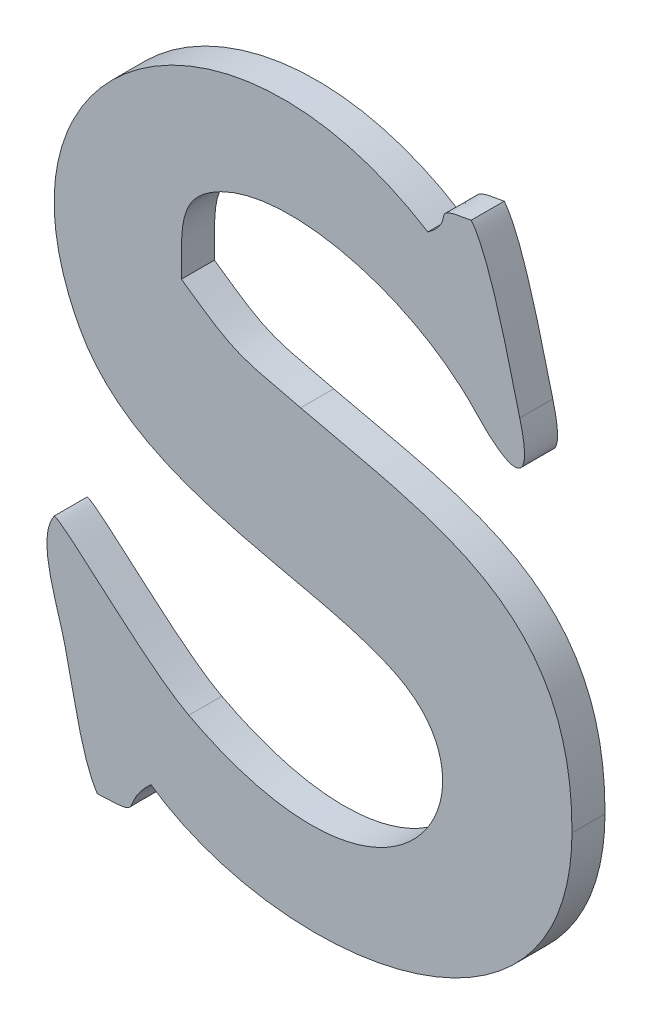
ISO-10303-21;
HEADER;
FILE_DESCRIPTION(('STEP AP214'),'2;1');
FILE_NAME('part.step','',(''),(''),'','','');
FILE_SCHEMA(('AUTOMOTIVE_DESIGN { 1 0 10303 214 1 1 1 1 }'));
ENDSEC;
DATA;
#1=APPLICATION_CONTEXT('core data for automotive mechanical design processes');
#2=APPLICATION_PROTOCOL_DEFINITION('international standard','automotive_design',2000,#1);
#3=PRODUCT_CONTEXT('',#1,'mechanical');
#4=PRODUCT('Part','Part','',(#3));
#5=PRODUCT_RELATED_PRODUCT_CATEGORY('part','',(#4));
#6=PRODUCT_DEFINITION_FORMATION('','',#4);
#7=PRODUCT_DEFINITION_CONTEXT('part definition',#1,'design');
#8=PRODUCT_DEFINITION('design','',#6,#7);
#9=PRODUCT_DEFINITION_SHAPE('','',#8);
#10=(LENGTH_UNIT() NAMED_UNIT(*) SI_UNIT(.MILLI.,.METRE.));
#11=(NAMED_UNIT(*) PLANE_ANGLE_UNIT() SI_UNIT($,.RADIAN.));
#12=(NAMED_UNIT(*) SI_UNIT($,.STERADIAN.) SOLID_ANGLE_UNIT());
#13=UNCERTAINTY_MEASURE_WITH_UNIT(LENGTH_MEASURE(1.E-05),#10,'distance_accuracy_value','');
#14=(GEOMETRIC_REPRESENTATION_CONTEXT(3) GLOBAL_UNCERTAINTY_ASSIGNED_CONTEXT((#13)) GLOBAL_UNIT_ASSIGNED_CONTEXT((#10,
#11,#12)) REPRESENTATION_CONTEXT('',''));
#15=CARTESIAN_POINT('',(0.,0.,0.));
#16=DIRECTION('',(0.,0.,1.));
#17=DIRECTION('',(1.,0.,0.));
#18=AXIS2_PLACEMENT_3D('',#15,#16,#17);
#19=CARTESIAN_POINT('',(50.1611139999998,11.206737,0.001));
#20=CARTESIAN_POINT('',(50.1611139999998,11.206737,0.));
#21=CARTESIAN_POINT('',(50.1640959999998,11.204861,0.001));
#22=CARTESIAN_POINT('',(50.1640959999998,11.204861,0.));
#23=CARTESIAN_POINT('',(50.1607779999998,11.199415,0.001));
#24=CARTESIAN_POINT('',(50.1607779999998,11.199415,0.));
#25=CARTESIAN_POINT('',(50.1545339999998,11.202691,0.001));
#26=CARTESIAN_POINT('',(50.1545339999998,11.202691,0.));
#27=B_SPLINE_SURFACE_WITH_KNOTS('',3,1,((#19,#20),(#21,#22),(#23,#24),(#25,#26)),.UNSPECIFIED.,
.F.,.F.,.F.,(4,4),(2,2),(0.8125,0.875),(0.,1.),.UNSPECIFIED.);
#28=CARTESIAN_POINT('',(50.1611139999998,11.206737,0.));
#29=CARTESIAN_POINT('',(50.1640959999998,11.204861,0.));
#30=CARTESIAN_POINT('',(50.1607779999998,11.199415,0.));
#31=CARTESIAN_POINT('',(50.1545339999998,11.202691,0.));
#32=B_SPLINE_CURVE_WITH_KNOTS('',3,(#28,#29,#30,#31),.UNSPECIFIED.,.F.,.F.,(4,4),(0.8125,0.875),.UNSPECIFIED.);
#33=CARTESIAN_POINT('',(50.1611139999998,11.206737,0.));
#34=VERTEX_POINT('',#33);
#35=CARTESIAN_POINT('',(50.1545339999998,11.202691,0.));
#36=VERTEX_POINT('',#35);
#37=EDGE_CURVE('E11',#34,#36,#32,.T.);
#38=DIRECTION('',(0.,0.,-1.));
#39=VECTOR('',#38,1.);
#40=CARTESIAN_POINT('',(50.1545339999998,11.202691,0.001));
#41=LINE('',#40,#39);
#42=CARTESIAN_POINT('',(50.1545339999998,11.202691,0.001));
#43=VERTEX_POINT('',#42);
#44=EDGE_CURVE('E28',#43,#36,#41,.T.);
#45=CARTESIAN_POINT('',(50.1611139999998,11.206737,0.001));
#46=CARTESIAN_POINT('',(50.1640959999998,11.204861,0.001));
#47=CARTESIAN_POINT('',(50.1607779999998,11.199415,0.001));
#48=CARTESIAN_POINT('',(50.1545339999998,11.202691,0.001));
#49=B_SPLINE_CURVE_WITH_KNOTS('',3,(#45,#46,#47,#48),.UNSPECIFIED.,.F.,.F.,(4,4),(0.8125,0.875),.UNSPECIFIED.);
#50=CARTESIAN_POINT('',(50.1611139999998,11.206737,0.001));
#51=VERTEX_POINT('',#50);
#52=EDGE_CURVE('E375',#51,#43,#49,.T.);
#53=DIRECTION('',(0.,0.,-1.));
#54=VECTOR('',#53,1.);
#55=CARTESIAN_POINT('',(50.1611139999998,11.206737,0.001));
#56=LINE('',#55,#54);
#57=EDGE_CURVE('E40',#51,#34,#56,.T.);
#58=ORIENTED_EDGE('',*,*,#37,.T.);
#59=ORIENTED_EDGE('',*,*,#44,.F.);
#60=ORIENTED_EDGE('',*,*,#52,.F.);
#61=ORIENTED_EDGE('',*,*,#57,.T.);
#62=EDGE_LOOP('',(#58,#59,#60,#61));
#63=FACE_BOUND('',#62,.T.);
#64=ADVANCED_FACE('F17',(#63),#27,.F.);
#65=CARTESIAN_POINT('',(50.1545339999998,11.202691,0.001));
#66=CARTESIAN_POINT('',(50.1545339999998,11.202691,0.));
#67=CARTESIAN_POINT('',(50.1532039999998,11.203391,0.001));
#68=CARTESIAN_POINT('',(50.1532039999998,11.203391,0.));
#69=CARTESIAN_POINT('',(50.1509219999998,11.205729,0.001));
#70=CARTESIAN_POINT('',(50.1509219999998,11.205729,0.));
#71=CARTESIAN_POINT('',(50.1504599999998,11.205883,0.001));
#72=CARTESIAN_POINT('',(50.1504599999998,11.205883,0.));
#73=B_SPLINE_SURFACE_WITH_KNOTS('',3,1,((#65,#66),(#67,#68),(#69,#70),(#71,#72)),.UNSPECIFIED.,
.F.,.F.,.F.,(4,4),(2,2),(0.875,1.),(0.,1.),.UNSPECIFIED.);
#74=CARTESIAN_POINT('',(50.1545339999998,11.202691,0.));
#75=CARTESIAN_POINT('',(50.1532039999998,11.203391,0.));
#76=CARTESIAN_POINT('',(50.1509219999998,11.205729,0.));
#77=CARTESIAN_POINT('',(50.1504599999998,11.205883,0.));
#78=B_SPLINE_CURVE_WITH_KNOTS('',3,(#74,#75,#76,#77),.UNSPECIFIED.,.F.,.F.,(4,4),(0.875,1.),.UNSPECIFIED.);
#79=CARTESIAN_POINT('',(50.1504599999998,11.205883,0.));
#80=VERTEX_POINT('',#79);
#81=EDGE_CURVE('E367',#36,#80,#78,.T.);
#82=DIRECTION('',(0.,0.,-1.));
#83=VECTOR('',#82,1.);
#84=CARTESIAN_POINT('',(50.1504599999998,11.205883,0.001));
#85=LINE('',#84,#83);
#86=CARTESIAN_POINT('',(50.1504599999998,11.205883,0.001));
#87=VERTEX_POINT('',#86);
#88=EDGE_CURVE('E362',#87,#80,#85,.T.);
#89=CARTESIAN_POINT('',(50.1545339999998,11.202691,0.001));
#90=CARTESIAN_POINT('',(50.1532039999998,11.203391,0.001));
#91=CARTESIAN_POINT('',(50.1509219999998,11.205729,0.001));
#92=CARTESIAN_POINT('',(50.1504599999998,11.205883,0.001));
#93=B_SPLINE_CURVE_WITH_KNOTS('',3,(#89,#90,#91,#92),.UNSPECIFIED.,.F.,.F.,(4,4),(0.875,1.),.UNSPECIFIED.);
#94=EDGE_CURVE('E355',#43,#87,#93,.T.);
#95=ORIENTED_EDGE('',*,*,#81,.T.);
#96=ORIENTED_EDGE('',*,*,#88,.F.);
#97=ORIENTED_EDGE('',*,*,#94,.F.);
#98=ORIENTED_EDGE('',*,*,#44,.T.);
#99=EDGE_LOOP('',(#95,#96,#97,#98));
#100=FACE_BOUND('',#99,.T.);
#101=ADVANCED_FACE('F383',(#100),#73,.F.);
#102=CARTESIAN_POINT('',(50.1504599999998,11.205883,0.001));
#103=CARTESIAN_POINT('',(50.1504599999998,11.205883,0.));
#104=CARTESIAN_POINT('',(50.1498999999998,11.205057,0.001));
#105=CARTESIAN_POINT('',(50.1498999999998,11.205057,0.));
#106=CARTESIAN_POINT('',(50.1505439999998,11.203657,0.001));
#107=CARTESIAN_POINT('',(50.1505439999998,11.203657,0.));
#108=CARTESIAN_POINT('',(50.1507819999998,11.202649,0.001));
#109=CARTESIAN_POINT('',(50.1507819999998,11.202649,0.));
#110=B_SPLINE_SURFACE_WITH_KNOTS('',3,1,((#102,#103),(#104,#105),(#106,#107),(#108,#109)),
.UNSPECIFIED.,.F.,.F.,.F.,(4,4),(2,2),(0.,0.0625),(0.,1.),.UNSPECIFIED.);
#111=CARTESIAN_POINT('',(50.1504599999998,11.205883,0.));
#112=CARTESIAN_POINT('',(50.1498999999998,11.205057,0.));
#113=CARTESIAN_POINT('',(50.1505439999998,11.203657,0.));
#114=CARTESIAN_POINT('',(50.1507819999998,11.202649,0.));
#115=B_SPLINE_CURVE_WITH_KNOTS('',3,(#111,#112,#113,#114),.UNSPECIFIED.,.F.,.F.,(4,4),(0.,
0.0625),.UNSPECIFIED.);
#116=CARTESIAN_POINT('',(50.1507819999998,11.202649,0.));
#117=VERTEX_POINT('',#116);
#118=EDGE_CURVE('E350',#80,#117,#115,.T.);
#119=DIRECTION('',(0.,0.,-1.));
#120=VECTOR('',#119,1.);
#121=CARTESIAN_POINT('',(50.1507819999998,11.202649,0.001));
#122=LINE('',#121,#120);
#123=CARTESIAN_POINT('',(50.1507819999998,11.202649,0.001));
#124=VERTEX_POINT('',#123);
#125=EDGE_CURVE('E345',#124,#117,#122,.T.);
#126=CARTESIAN_POINT('',(50.1504599999998,11.205883,0.001));
#127=CARTESIAN_POINT('',(50.1498999999998,11.205057,0.001));
#128=CARTESIAN_POINT('',(50.1505439999998,11.203657,0.001));
#129=CARTESIAN_POINT('',(50.1507819999998,11.202649,0.001));
#130=B_SPLINE_CURVE_WITH_KNOTS('',3,(#126,#127,#128,#129),.UNSPECIFIED.,.F.,.F.,(4,4),(0.,
0.0625),.UNSPECIFIED.);
#131=EDGE_CURVE('E338',#87,#124,#130,.T.);
#132=ORIENTED_EDGE('',*,*,#118,.T.);
#133=ORIENTED_EDGE('',*,*,#125,.F.);
#134=ORIENTED_EDGE('',*,*,#131,.F.);
#135=ORIENTED_EDGE('',*,*,#88,.T.);
#136=EDGE_LOOP('',(#132,#133,#134,#135));
#137=FACE_BOUND('',#136,.T.);
#138=ADVANCED_FACE('F388',(#137),#110,.F.);
#139=CARTESIAN_POINT('',(50.1507819999998,11.202649,0.001));
#140=CARTESIAN_POINT('',(50.1507819999998,11.202649,0.));
#141=CARTESIAN_POINT('',(50.1510759999998,11.201445,0.001));
#142=CARTESIAN_POINT('',(50.1510759999998,11.201445,0.));
#143=CARTESIAN_POINT('',(50.1512719999998,11.199989,0.001));
#144=CARTESIAN_POINT('',(50.1512719999998,11.199989,0.));
#145=CARTESIAN_POINT('',(50.1517619999998,11.199247,0.001));
#146=CARTESIAN_POINT('',(50.1517619999998,11.199247,0.));
#147=B_SPLINE_SURFACE_WITH_KNOTS('',3,1,((#139,#140),(#141,#142),(#143,#144),(#145,#146)),
.UNSPECIFIED.,.F.,.F.,.F.,(4,4),(2,2),(0.0625,0.125),(0.,1.),.UNSPECIFIED.);
#148=CARTESIAN_POINT('',(50.1507819999998,11.202649,0.));
#149=CARTESIAN_POINT('',(50.1510759999998,11.201445,0.));
#150=CARTESIAN_POINT('',(50.1512719999998,11.199989,0.));
#151=CARTESIAN_POINT('',(50.1517619999998,11.199247,0.));
#152=B_SPLINE_CURVE_WITH_KNOTS('',3,(#148,#149,#150,#151),.UNSPECIFIED.,.F.,.F.,(4,4),(0.0625,
0.125),.UNSPECIFIED.);
#153=CARTESIAN_POINT('',(50.1517619999998,11.199247,0.));
#154=VERTEX_POINT('',#153);
#155=EDGE_CURVE('E333',#117,#154,#152,.T.);
#156=DIRECTION('',(0.,0.,-1.));
#157=VECTOR('',#156,1.);
#158=CARTESIAN_POINT('',(50.1517619999998,11.199247,0.001));
#159=LINE('',#158,#157);
#160=CARTESIAN_POINT('',(50.1517619999998,11.199247,0.001));
#161=VERTEX_POINT('',#160);
#162=EDGE_CURVE('E328',#161,#154,#159,.T.);
#163=CARTESIAN_POINT('',(50.1507819999998,11.202649,0.001));
#164=CARTESIAN_POINT('',(50.1510759999998,11.201445,0.001));
#165=CARTESIAN_POINT('',(50.1512719999998,11.199989,0.001));
#166=CARTESIAN_POINT('',(50.1517619999998,11.199247,0.001));
#167=B_SPLINE_CURVE_WITH_KNOTS('',3,(#163,#164,#165,#166),.UNSPECIFIED.,.F.,.F.,(4,4),(0.0625,
0.125),.UNSPECIFIED.);
#168=EDGE_CURVE('E321',#124,#161,#167,.T.);
#169=ORIENTED_EDGE('',*,*,#155,.T.);
#170=ORIENTED_EDGE('',*,*,#162,.F.);
#171=ORIENTED_EDGE('',*,*,#168,.F.);
#172=ORIENTED_EDGE('',*,*,#125,.T.);
#173=EDGE_LOOP('',(#169,#170,#171,#172));
#174=FACE_BOUND('',#173,.T.);
#175=ADVANCED_FACE('F394',(#174),#147,.F.);
#176=CARTESIAN_POINT('',(50.1517619999998,11.199247,0.001));
#177=CARTESIAN_POINT('',(50.1517619999998,11.199247,0.));
#178=CARTESIAN_POINT('',(50.1533299999998,11.199289,0.001));
#179=CARTESIAN_POINT('',(50.1533299999998,11.199289,0.));
#180=CARTESIAN_POINT('',(50.1523779999998,11.199359,0.001));
#181=CARTESIAN_POINT('',(50.1523779999998,11.199359,0.));
#182=CARTESIAN_POINT('',(50.1533859999998,11.200297,0.001));
#183=CARTESIAN_POINT('',(50.1533859999998,11.200297,0.));
#184=B_SPLINE_SURFACE_WITH_KNOTS('',3,1,((#176,#177),(#178,#179),(#180,#181),(#182,#183)),
.UNSPECIFIED.,.F.,.F.,.F.,(4,4),(2,2),(0.125,0.1875),(0.,1.),.UNSPECIFIED.);
#185=CARTESIAN_POINT('',(50.1517619999998,11.199247,0.));
#186=CARTESIAN_POINT('',(50.1533299999998,11.199289,0.));
#187=CARTESIAN_POINT('',(50.1523779999998,11.199359,0.));
#188=CARTESIAN_POINT('',(50.1533859999998,11.200297,0.));
#189=B_SPLINE_CURVE_WITH_KNOTS('',3,(#185,#186,#187,#188),.UNSPECIFIED.,.F.,.F.,(4,4),(0.125,
0.1875),.UNSPECIFIED.);
#190=CARTESIAN_POINT('',(50.1533859999998,11.200297,0.));
#191=VERTEX_POINT('',#190);
#192=EDGE_CURVE('E316',#154,#191,#189,.T.);
#193=DIRECTION('',(0.,0.,-1.));
#194=VECTOR('',#193,1.);
#195=CARTESIAN_POINT('',(50.1533859999998,11.200297,0.001));
#196=LINE('',#195,#194);
#197=CARTESIAN_POINT('',(50.1533859999998,11.200297,0.001));
#198=VERTEX_POINT('',#197);
#199=EDGE_CURVE('E311',#198,#191,#196,.T.);
#200=CARTESIAN_POINT('',(50.1517619999998,11.199247,0.001));
#201=CARTESIAN_POINT('',(50.1533299999998,11.199289,0.001));
#202=CARTESIAN_POINT('',(50.1523779999998,11.199359,0.001));
#203=CARTESIAN_POINT('',(50.1533859999998,11.200297,0.001));
#204=B_SPLINE_CURVE_WITH_KNOTS('',3,(#200,#201,#202,#203),.UNSPECIFIED.,.F.,.F.,(4,4),(0.125,
0.1875),.UNSPECIFIED.);
#205=EDGE_CURVE('E304',#161,#198,#204,.T.);
#206=ORIENTED_EDGE('',*,*,#192,.T.);
#207=ORIENTED_EDGE('',*,*,#199,.F.);
#208=ORIENTED_EDGE('',*,*,#205,.F.);
#209=ORIENTED_EDGE('',*,*,#162,.T.);
#210=EDGE_LOOP('',(#206,#207,#208,#209));
#211=FACE_BOUND('',#210,.T.);
#212=ADVANCED_FACE('F398',(#211),#184,.F.);
#213=CARTESIAN_POINT('',(50.1533859999998,11.200297,0.001));
#214=CARTESIAN_POINT('',(50.1533859999998,11.200297,0.));
#215=CARTESIAN_POINT('',(50.1574179999998,11.197483,0.001));
#216=CARTESIAN_POINT('',(50.1574179999998,11.197483,0.));
#217=CARTESIAN_POINT('',(50.1660979999998,11.198771,0.001));
#218=CARTESIAN_POINT('',(50.1660979999998,11.198771,0.));
#219=CARTESIAN_POINT('',(50.1661399999998,11.205407,0.001));
#220=CARTESIAN_POINT('',(50.1661399999998,11.205407,0.));
#221=B_SPLINE_SURFACE_WITH_KNOTS('',3,1,((#213,#214),(#215,#216),(#217,#218),(#219,#220)),
.UNSPECIFIED.,.F.,.F.,.F.,(4,4),(2,2),(0.1875,0.25),(0.,1.),.UNSPECIFIED.);
#222=CARTESIAN_POINT('',(50.1533859999998,11.200297,0.));
#223=CARTESIAN_POINT('',(50.1574179999998,11.197483,0.));
#224=CARTESIAN_POINT('',(50.1660979999998,11.198771,0.));
#225=CARTESIAN_POINT('',(50.1661399999998,11.205407,0.));
#226=B_SPLINE_CURVE_WITH_KNOTS('',3,(#222,#223,#224,#225),.UNSPECIFIED.,.F.,.F.,(4,4),(0.1875,
0.25),.UNSPECIFIED.);
#227=CARTESIAN_POINT('',(50.1661399999998,11.205407,0.));
#228=VERTEX_POINT('',#227);
#229=EDGE_CURVE('E299',#191,#228,#226,.T.);
#230=DIRECTION('',(0.,0.,-1.));
#231=VECTOR('',#230,1.);
#232=CARTESIAN_POINT('',(50.1661399999998,11.205407,0.001));
#233=LINE('',#232,#231);
#234=CARTESIAN_POINT('',(50.1661399999998,11.205407,0.001));
#235=VERTEX_POINT('',#234);
#236=EDGE_CURVE('E294',#235,#228,#233,.T.);
#237=CARTESIAN_POINT('',(50.1533859999998,11.200297,0.001));
#238=CARTESIAN_POINT('',(50.1574179999998,11.197483,0.001));
#239=CARTESIAN_POINT('',(50.1660979999998,11.198771,0.001));
#240=CARTESIAN_POINT('',(50.1661399999998,11.205407,0.001));
#241=B_SPLINE_CURVE_WITH_KNOTS('',3,(#237,#238,#239,#240),.UNSPECIFIED.,.F.,.F.,(4,4),(0.1875,
0.25),.UNSPECIFIED.);
#242=EDGE_CURVE('E287',#198,#235,#241,.T.);
#243=ORIENTED_EDGE('',*,*,#229,.T.);
#244=ORIENTED_EDGE('',*,*,#236,.F.);
#245=ORIENTED_EDGE('',*,*,#242,.F.);
#246=ORIENTED_EDGE('',*,*,#199,.T.);
#247=EDGE_LOOP('',(#243,#244,#245,#246));
#248=FACE_BOUND('',#247,.T.);
#249=ADVANCED_FACE('F403',(#248),#221,.F.);
#250=CARTESIAN_POINT('',(50.1661399999998,11.205407,0.001));
#251=CARTESIAN_POINT('',(50.1661399999998,11.205407,0.));
#252=CARTESIAN_POINT('',(50.1661679999998,11.211105,0.001));
#253=CARTESIAN_POINT('',(50.1661679999998,11.211105,0.));
#254=CARTESIAN_POINT('',(50.1619399999998,11.211483,0.001));
#255=CARTESIAN_POINT('',(50.1619399999998,11.211483,0.));
#256=CARTESIAN_POINT('',(50.1579219999998,11.212449,0.001));
#257=CARTESIAN_POINT('',(50.1579219999998,11.212449,0.));
#258=B_SPLINE_SURFACE_WITH_KNOTS('',3,1,((#250,#251),(#252,#253),(#254,#255),(#256,#257)),
.UNSPECIFIED.,.F.,.F.,.F.,(4,4),(2,2),(0.25,0.3125),(0.,1.),.UNSPECIFIED.);
#259=CARTESIAN_POINT('',(50.1661399999998,11.205407,0.));
#260=CARTESIAN_POINT('',(50.1661679999998,11.211105,0.));
#261=CARTESIAN_POINT('',(50.1619399999998,11.211483,0.));
#262=CARTESIAN_POINT('',(50.1579219999998,11.212449,0.));
#263=B_SPLINE_CURVE_WITH_KNOTS('',3,(#259,#260,#261,#262),.UNSPECIFIED.,.F.,.F.,(4,4),(0.25,
0.3125),.UNSPECIFIED.);
#264=CARTESIAN_POINT('',(50.1579219999998,11.212449,0.));
#265=VERTEX_POINT('',#264);
#266=EDGE_CURVE('E282',#228,#265,#263,.T.);
#267=DIRECTION('',(0.,0.,-1.));
#268=VECTOR('',#267,1.);
#269=CARTESIAN_POINT('',(50.1579219999998,11.212449,0.001));
#270=LINE('',#269,#268);
#271=CARTESIAN_POINT('',(50.1579219999998,11.212449,0.001));
#272=VERTEX_POINT('',#271);
#273=EDGE_CURVE('E277',#272,#265,#270,.T.);
#274=CARTESIAN_POINT('',(50.1661399999998,11.205407,0.001));
#275=CARTESIAN_POINT('',(50.1661679999998,11.211105,0.001));
#276=CARTESIAN_POINT('',(50.1619399999998,11.211483,0.001));
#277=CARTESIAN_POINT('',(50.1579219999998,11.212449,0.001));
#278=B_SPLINE_CURVE_WITH_KNOTS('',3,(#274,#275,#276,#277),.UNSPECIFIED.,.F.,.F.,(4,4),(0.25,
0.3125),.UNSPECIFIED.);
#279=EDGE_CURVE('E270',#235,#272,#278,.T.);
#280=ORIENTED_EDGE('',*,*,#266,.T.);
#281=ORIENTED_EDGE('',*,*,#273,.F.);
#282=ORIENTED_EDGE('',*,*,#279,.F.);
#283=ORIENTED_EDGE('',*,*,#236,.T.);
#284=EDGE_LOOP('',(#280,#281,#282,#283));
#285=FACE_BOUND('',#284,.T.);
#286=ADVANCED_FACE('F409',(#285),#258,.F.);
#287=CARTESIAN_POINT('',(50.1579219999998,11.212449,0.001));
#288=CARTESIAN_POINT('',(50.1579219999998,11.212449,0.));
#289=CARTESIAN_POINT('',(50.1559619999998,11.212911,0.001));
#290=CARTESIAN_POINT('',(50.1559619999998,11.212911,0.));
#291=CARTESIAN_POINT('',(50.1559619999998,11.212855,0.001));
#292=CARTESIAN_POINT('',(50.1559619999998,11.212855,0.));
#293=CARTESIAN_POINT('',(50.1543099999998,11.214017,0.001));
#294=CARTESIAN_POINT('',(50.1543099999998,11.214017,0.));
#295=B_SPLINE_SURFACE_WITH_KNOTS('',3,1,((#287,#288),(#289,#290),(#291,#292),(#293,#294)),
.UNSPECIFIED.,.F.,.F.,.F.,(4,4),(2,2),(0.3125,0.375),(0.,1.),.UNSPECIFIED.);
#296=CARTESIAN_POINT('',(50.1579219999998,11.212449,0.));
#297=CARTESIAN_POINT('',(50.1559619999998,11.212911,0.));
#298=CARTESIAN_POINT('',(50.1559619999998,11.212855,0.));
#299=CARTESIAN_POINT('',(50.1543099999998,11.214017,0.));
#300=B_SPLINE_CURVE_WITH_KNOTS('',3,(#296,#297,#298,#299),.UNSPECIFIED.,.F.,.F.,(4,4),(0.3125,
0.375),.UNSPECIFIED.);
#301=CARTESIAN_POINT('',(50.1543099999998,11.214017,0.));
#302=VERTEX_POINT('',#301);
#303=EDGE_CURVE('E265',#265,#302,#300,.T.);
#304=DIRECTION('',(0.,0.,-1.));
#305=VECTOR('',#304,1.);
#306=CARTESIAN_POINT('',(50.1543099999998,11.214017,0.001));
#307=LINE('',#306,#305);
#308=CARTESIAN_POINT('',(50.1543099999998,11.214017,0.001));
#309=VERTEX_POINT('',#308);
#310=EDGE_CURVE('E260',#309,#302,#307,.T.);
#311=CARTESIAN_POINT('',(50.1579219999998,11.212449,0.001));
#312=CARTESIAN_POINT('',(50.1559619999998,11.212911,0.001));
#313=CARTESIAN_POINT('',(50.1559619999998,11.212855,0.001));
#314=CARTESIAN_POINT('',(50.1543099999998,11.214017,0.001));
#315=B_SPLINE_CURVE_WITH_KNOTS('',3,(#311,#312,#313,#314),.UNSPECIFIED.,.F.,.F.,(4,4),(0.3125,
0.375),.UNSPECIFIED.);
#316=EDGE_CURVE('E253',#272,#309,#315,.T.);
#317=ORIENTED_EDGE('',*,*,#303,.T.);
#318=ORIENTED_EDGE('',*,*,#310,.F.);
#319=ORIENTED_EDGE('',*,*,#316,.F.);
#320=ORIENTED_EDGE('',*,*,#273,.T.);
#321=EDGE_LOOP('',(#317,#318,#319,#320));
#322=FACE_BOUND('',#321,.T.);
#323=ADVANCED_FACE('F413',(#322),#295,.F.);
#324=CARTESIAN_POINT('',(50.1543099999998,11.214017,0.001));
#325=CARTESIAN_POINT('',(50.1543099999998,11.214017,0.));
#326=CARTESIAN_POINT('',(50.1543099999998,11.215431,0.001));
#327=CARTESIAN_POINT('',(50.1543099999998,11.215431,0.));
#328=CARTESIAN_POINT('',(50.1541839999998,11.216243,0.001));
#329=CARTESIAN_POINT('',(50.1541839999998,11.216243,0.));
#330=CARTESIAN_POINT('',(50.1555139999998,11.216915,0.001));
#331=CARTESIAN_POINT('',(50.1555139999998,11.216915,0.));
#332=B_SPLINE_SURFACE_WITH_KNOTS('',3,1,((#324,#325),(#326,#327),(#328,#329),(#330,#331)),
.UNSPECIFIED.,.F.,.F.,.F.,(4,4),(2,2),(0.375,0.4375),(0.,1.),.UNSPECIFIED.);
#333=CARTESIAN_POINT('',(50.1543099999998,11.214017,0.));
#334=CARTESIAN_POINT('',(50.1543099999998,11.215431,0.));
#335=CARTESIAN_POINT('',(50.1541839999998,11.216243,0.));
#336=CARTESIAN_POINT('',(50.1555139999998,11.216915,0.));
#337=B_SPLINE_CURVE_WITH_KNOTS('',3,(#333,#334,#335,#336),.UNSPECIFIED.,.F.,.F.,(4,4),(0.375,
0.4375),.UNSPECIFIED.);
#338=CARTESIAN_POINT('',(50.1555139999998,11.216915,0.));
#339=VERTEX_POINT('',#338);
#340=EDGE_CURVE('E248',#302,#339,#337,.T.);
#341=DIRECTION('',(0.,0.,-1.));
#342=VECTOR('',#341,1.);
#343=CARTESIAN_POINT('',(50.1555139999998,11.216915,0.001));
#344=LINE('',#343,#342);
#345=CARTESIAN_POINT('',(50.1555139999998,11.216915,0.001));
#346=VERTEX_POINT('',#345);
#347=EDGE_CURVE('E243',#346,#339,#344,.T.);
#348=CARTESIAN_POINT('',(50.1543099999998,11.214017,0.001));
#349=CARTESIAN_POINT('',(50.1543099999998,11.215431,0.001));
#350=CARTESIAN_POINT('',(50.1541839999998,11.216243,0.001));
#351=CARTESIAN_POINT('',(50.1555139999998,11.216915,0.001));
#352=B_SPLINE_CURVE_WITH_KNOTS('',3,(#348,#349,#350,#351),.UNSPECIFIED.,.F.,.F.,(4,4),(0.375,
0.4375),.UNSPECIFIED.);
#353=EDGE_CURVE('E236',#309,#346,#352,.T.);
#354=ORIENTED_EDGE('',*,*,#340,.T.);
#355=ORIENTED_EDGE('',*,*,#347,.F.);
#356=ORIENTED_EDGE('',*,*,#353,.F.);
#357=ORIENTED_EDGE('',*,*,#310,.T.);
#358=EDGE_LOOP('',(#354,#355,#356,#357));
#359=FACE_BOUND('',#358,.T.);
#360=ADVANCED_FACE('F418',(#359),#332,.F.);
#361=CARTESIAN_POINT('',(50.1555139999998,11.216915,0.001));
#362=CARTESIAN_POINT('',(50.1555139999998,11.216915,0.));
#363=CARTESIAN_POINT('',(50.1576279999998,11.217979,0.001));
#364=CARTESIAN_POINT('',(50.1576279999998,11.217979,0.));
#365=CARTESIAN_POINT('',(50.1613659999998,11.217027,0.001));
#366=CARTESIAN_POINT('',(50.1613659999998,11.217027,0.));
#367=CARTESIAN_POINT('',(50.1632839999998,11.214927,0.001));
#368=CARTESIAN_POINT('',(50.1632839999998,11.214927,0.));
#369=B_SPLINE_SURFACE_WITH_KNOTS('',3,1,((#361,#362),(#363,#364),(#365,#366),(#367,#368)),
.UNSPECIFIED.,.F.,.F.,.F.,(4,4),(2,2),(0.4375,0.5),(0.,1.),.UNSPECIFIED.);
#370=CARTESIAN_POINT('',(50.1555139999998,11.216915,0.));
#371=CARTESIAN_POINT('',(50.1576279999998,11.217979,0.));
#372=CARTESIAN_POINT('',(50.1613659999998,11.217027,0.));
#373=CARTESIAN_POINT('',(50.1632839999998,11.214927,0.));
#374=B_SPLINE_CURVE_WITH_KNOTS('',3,(#370,#371,#372,#373),.UNSPECIFIED.,.F.,.F.,(4,4),(0.4375,
0.5),.UNSPECIFIED.);
#375=CARTESIAN_POINT('',(50.1632839999998,11.214927,0.));
#376=VERTEX_POINT('',#375);
#377=EDGE_CURVE('E231',#339,#376,#374,.T.);
#378=DIRECTION('',(0.,0.,-1.));
#379=VECTOR('',#378,1.);
#380=CARTESIAN_POINT('',(50.1632839999998,11.214927,0.001));
#381=LINE('',#380,#379);
#382=CARTESIAN_POINT('',(50.1632839999998,11.214927,0.001));
#383=VERTEX_POINT('',#382);
#384=EDGE_CURVE('E226',#383,#376,#381,.T.);
#385=CARTESIAN_POINT('',(50.1555139999998,11.216915,0.001));
#386=CARTESIAN_POINT('',(50.1576279999998,11.217979,0.001));
#387=CARTESIAN_POINT('',(50.1613659999998,11.217027,0.001));
#388=CARTESIAN_POINT('',(50.1632839999998,11.214927,0.001));
#389=B_SPLINE_CURVE_WITH_KNOTS('',3,(#385,#386,#387,#388),.UNSPECIFIED.,.F.,.F.,(4,4),(0.4375,
0.5),.UNSPECIFIED.);
#390=EDGE_CURVE('E219',#346,#383,#389,.T.);
#391=ORIENTED_EDGE('',*,*,#377,.T.);
#392=ORIENTED_EDGE('',*,*,#384,.F.);
#393=ORIENTED_EDGE('',*,*,#390,.F.);
#394=ORIENTED_EDGE('',*,*,#347,.T.);
#395=EDGE_LOOP('',(#391,#392,#393,#394));
#396=FACE_BOUND('',#395,.T.);
#397=ADVANCED_FACE('F424',(#396),#369,.F.);
#398=CARTESIAN_POINT('',(50.1632839999998,11.214927,0.001));
#399=CARTESIAN_POINT('',(50.1632839999998,11.214927,0.));
#400=CARTESIAN_POINT('',(50.1641519999998,11.213989,0.001));
#401=CARTESIAN_POINT('',(50.1641519999998,11.213989,0.));
#402=CARTESIAN_POINT('',(50.1650619999998,11.213583,0.001));
#403=CARTESIAN_POINT('',(50.1650619999998,11.213583,0.));
#404=CARTESIAN_POINT('',(50.1645579999998,11.215501,0.001));
#405=CARTESIAN_POINT('',(50.1645579999998,11.215501,0.));
#406=B_SPLINE_SURFACE_WITH_KNOTS('',3,1,((#398,#399),(#400,#401),(#402,#403),(#404,#405)),
.UNSPECIFIED.,.F.,.F.,.F.,(4,4),(2,2),(0.5,0.5625),(0.,1.),.UNSPECIFIED.);
#407=CARTESIAN_POINT('',(50.1632839999998,11.214927,0.));
#408=CARTESIAN_POINT('',(50.1641519999998,11.213989,0.));
#409=CARTESIAN_POINT('',(50.1650619999998,11.213583,0.));
#410=CARTESIAN_POINT('',(50.1645579999998,11.215501,0.));
#411=B_SPLINE_CURVE_WITH_KNOTS('',3,(#407,#408,#409,#410),.UNSPECIFIED.,.F.,.F.,(4,4),(0.5,
0.5625),.UNSPECIFIED.);
#412=CARTESIAN_POINT('',(50.1645579999998,11.215501,0.));
#413=VERTEX_POINT('',#412);
#414=EDGE_CURVE('E214',#376,#413,#411,.T.);
#415=DIRECTION('',(0.,0.,-1.));
#416=VECTOR('',#415,1.);
#417=CARTESIAN_POINT('',(50.1645579999998,11.215501,0.001));
#418=LINE('',#417,#416);
#419=CARTESIAN_POINT('',(50.1645579999998,11.215501,0.001));
#420=VERTEX_POINT('',#419);
#421=EDGE_CURVE('E209',#420,#413,#418,.T.);
#422=CARTESIAN_POINT('',(50.1632839999998,11.214927,0.001));
#423=CARTESIAN_POINT('',(50.1641519999998,11.213989,0.001));
#424=CARTESIAN_POINT('',(50.1650619999998,11.213583,0.001));
#425=CARTESIAN_POINT('',(50.1645579999998,11.215501,0.001));
#426=B_SPLINE_CURVE_WITH_KNOTS('',3,(#422,#423,#424,#425),.UNSPECIFIED.,.F.,.F.,(4,4),(0.5,
0.5625),.UNSPECIFIED.);
#427=EDGE_CURVE('E202',#383,#420,#426,.T.);
#428=ORIENTED_EDGE('',*,*,#414,.T.);
#429=ORIENTED_EDGE('',*,*,#421,.F.);
#430=ORIENTED_EDGE('',*,*,#427,.F.);
#431=ORIENTED_EDGE('',*,*,#384,.T.);
#432=EDGE_LOOP('',(#428,#429,#430,#431));
#433=FACE_BOUND('',#432,.T.);
#434=ADVANCED_FACE('F428',(#433),#406,.F.);
#435=CARTESIAN_POINT('',(50.1645579999998,11.215501,0.001));
#436=CARTESIAN_POINT('',(50.1645579999998,11.215501,0.));
#437=CARTESIAN_POINT('',(50.1642919999998,11.216537,0.001));
#438=CARTESIAN_POINT('',(50.1642919999998,11.216537,0.));
#439=CARTESIAN_POINT('',(50.1636759999998,11.219239,0.001));
#440=CARTESIAN_POINT('',(50.1636759999998,11.219239,0.));
#441=CARTESIAN_POINT('',(50.1630879999998,11.219953,0.001));
#442=CARTESIAN_POINT('',(50.1630879999998,11.219953,0.));
#443=B_SPLINE_SURFACE_WITH_KNOTS('',3,1,((#435,#436),(#437,#438),(#439,#440),(#441,#442)),
.UNSPECIFIED.,.F.,.F.,.F.,(4,4),(2,2),(0.5625,0.625),(0.,1.),.UNSPECIFIED.);
#444=CARTESIAN_POINT('',(50.1645579999998,11.215501,0.));
#445=CARTESIAN_POINT('',(50.1642919999998,11.216537,0.));
#446=CARTESIAN_POINT('',(50.1636759999998,11.219239,0.));
#447=CARTESIAN_POINT('',(50.1630879999998,11.219953,0.));
#448=B_SPLINE_CURVE_WITH_KNOTS('',3,(#444,#445,#446,#447),.UNSPECIFIED.,.F.,.F.,(4,4),(0.5625,
0.625),.UNSPECIFIED.);
#449=CARTESIAN_POINT('',(50.1630879999998,11.219953,0.));
#450=VERTEX_POINT('',#449);
#451=EDGE_CURVE('E197',#413,#450,#448,.T.);
#452=DIRECTION('',(0.,0.,-1.));
#453=VECTOR('',#452,1.);
#454=CARTESIAN_POINT('',(50.1630879999998,11.219953,0.001));
#455=LINE('',#454,#453);
#456=CARTESIAN_POINT('',(50.1630879999998,11.219953,0.001));
#457=VERTEX_POINT('',#456);
#458=EDGE_CURVE('E192',#457,#450,#455,.T.);
#459=CARTESIAN_POINT('',(50.1645579999998,11.215501,0.001));
#460=CARTESIAN_POINT('',(50.1642919999998,11.216537,0.001));
#461=CARTESIAN_POINT('',(50.1636759999998,11.219239,0.001));
#462=CARTESIAN_POINT('',(50.1630879999998,11.219953,0.001));
#463=B_SPLINE_CURVE_WITH_KNOTS('',3,(#459,#460,#461,#462),.UNSPECIFIED.,.F.,.F.,(4,4),(0.5625,
0.625),.UNSPECIFIED.);
#464=EDGE_CURVE('E185',#420,#457,#463,.T.);
#465=ORIENTED_EDGE('',*,*,#451,.T.);
#466=ORIENTED_EDGE('',*,*,#458,.F.);
#467=ORIENTED_EDGE('',*,*,#464,.F.);
#468=ORIENTED_EDGE('',*,*,#421,.T.);
#469=EDGE_LOOP('',(#465,#466,#467,#468));
#470=FACE_BOUND('',#469,.T.);
#471=ADVANCED_FACE('F433',(#470),#443,.F.);
#472=CARTESIAN_POINT('',(50.1630879999998,11.219953,0.001));
#473=CARTESIAN_POINT('',(50.1630879999998,11.219953,0.));
#474=CARTESIAN_POINT('',(50.1616739999998,11.219743,0.001));
#475=CARTESIAN_POINT('',(50.1616739999998,11.219743,0.));
#476=CARTESIAN_POINT('',(50.1627099999998,11.219673,0.001));
#477=CARTESIAN_POINT('',(50.1627099999998,11.219673,0.));
#478=CARTESIAN_POINT('',(50.1617719999998,11.218987,0.001));
#479=CARTESIAN_POINT('',(50.1617719999998,11.218987,0.));
#480=B_SPLINE_SURFACE_WITH_KNOTS('',3,1,((#472,#473),(#474,#475),(#476,#477),(#478,#479)),
.UNSPECIFIED.,.F.,.F.,.F.,(4,4),(2,2),(0.625,0.6875),(0.,1.),.UNSPECIFIED.);
#481=CARTESIAN_POINT('',(50.1630879999998,11.219953,0.));
#482=CARTESIAN_POINT('',(50.1616739999998,11.219743,0.));
#483=CARTESIAN_POINT('',(50.1627099999998,11.219673,0.));
#484=CARTESIAN_POINT('',(50.1617719999998,11.218987,0.));
#485=B_SPLINE_CURVE_WITH_KNOTS('',3,(#481,#482,#483,#484),.UNSPECIFIED.,.F.,.F.,(4,4),(0.625,
0.6875),.UNSPECIFIED.);
#486=CARTESIAN_POINT('',(50.1617719999998,11.218987,0.));
#487=VERTEX_POINT('',#486);
#488=EDGE_CURVE('E180',#450,#487,#485,.T.);
#489=DIRECTION('',(0.,0.,-1.));
#490=VECTOR('',#489,1.);
#491=CARTESIAN_POINT('',(50.1617719999998,11.218987,0.001));
#492=LINE('',#491,#490);
#493=CARTESIAN_POINT('',(50.1617719999998,11.218987,0.001));
#494=VERTEX_POINT('',#493);
#495=EDGE_CURVE('E175',#494,#487,#492,.T.);
#496=CARTESIAN_POINT('',(50.1630879999998,11.219953,0.001));
#497=CARTESIAN_POINT('',(50.1616739999998,11.219743,0.001));
#498=CARTESIAN_POINT('',(50.1627099999998,11.219673,0.001));
#499=CARTESIAN_POINT('',(50.1617719999998,11.218987,0.001));
#500=B_SPLINE_CURVE_WITH_KNOTS('',3,(#496,#497,#498,#499),.UNSPECIFIED.,.F.,.F.,(4,4),(0.625,
0.6875),.UNSPECIFIED.);
#501=EDGE_CURVE('E133',#457,#494,#500,.T.);
#502=ORIENTED_EDGE('',*,*,#488,.T.);
#503=ORIENTED_EDGE('',*,*,#495,.F.);
#504=ORIENTED_EDGE('',*,*,#501,.F.);
#505=ORIENTED_EDGE('',*,*,#458,.T.);
#506=EDGE_LOOP('',(#502,#503,#504,#505));
#507=FACE_BOUND('',#506,.T.);
#508=ADVANCED_FACE('F436',(#507),#480,.F.);
#509=CARTESIAN_POINT('',(50.1617719999998,11.218987,0.001));
#510=CARTESIAN_POINT('',(50.1617719999998,11.218987,0.));
#511=CARTESIAN_POINT('',(50.1555139999998,11.222921,0.001));
#512=CARTESIAN_POINT('',(50.1555139999998,11.222921,0.));
#513=CARTESIAN_POINT('',(50.1480239999998,11.217223,0.001));
#514=CARTESIAN_POINT('',(50.1480239999998,11.217223,0.));
#515=CARTESIAN_POINT('',(50.1512159999998,11.211217,0.001));
#516=CARTESIAN_POINT('',(50.1512159999998,11.211217,0.));
#517=B_SPLINE_SURFACE_WITH_KNOTS('',3,1,((#509,#510),(#511,#512),(#513,#514),(#515,#516)),
.UNSPECIFIED.,.F.,.F.,.F.,(4,4),(2,2),(0.6875,0.75),(0.,1.),.UNSPECIFIED.);
#518=CARTESIAN_POINT('',(50.1617719999998,11.218987,0.));
#519=CARTESIAN_POINT('',(50.1555139999998,11.222921,0.));
#520=CARTESIAN_POINT('',(50.1480239999998,11.217223,0.));
#521=CARTESIAN_POINT('',(50.1512159999998,11.211217,0.));
#522=B_SPLINE_CURVE_WITH_KNOTS('',3,(#518,#519,#520,#521),.UNSPECIFIED.,.F.,.F.,(4,4),(0.6875,
0.75),.UNSPECIFIED.);
#523=CARTESIAN_POINT('',(50.1512159999998,11.211217,0.));
#524=VERTEX_POINT('',#523);
#525=EDGE_CURVE('E142',#487,#524,#522,.T.);
#526=DIRECTION('',(0.,0.,-1.));
#527=VECTOR('',#526,1.);
#528=CARTESIAN_POINT('',(50.1512159999998,11.211217,0.001));
#529=LINE('',#528,#527);
#530=CARTESIAN_POINT('',(50.1512159999998,11.211217,0.001));
#531=VERTEX_POINT('',#530);
#532=EDGE_CURVE('E136',#531,#524,#529,.T.);
#533=CARTESIAN_POINT('',(50.1617719999998,11.218987,0.001));
#534=CARTESIAN_POINT('',(50.1555139999998,11.222921,0.001));
#535=CARTESIAN_POINT('',(50.1480239999998,11.217223,0.001));
#536=CARTESIAN_POINT('',(50.1512159999998,11.211217,0.001));
#537=B_SPLINE_CURVE_WITH_KNOTS('',3,(#533,#534,#535,#536),.UNSPECIFIED.,.F.,.F.,(4,4),(0.6875,
0.75),.UNSPECIFIED.);
#538=EDGE_CURVE('E127',#494,#531,#537,.T.);
#539=ORIENTED_EDGE('',*,*,#525,.T.);
#540=ORIENTED_EDGE('',*,*,#532,.F.);
#541=ORIENTED_EDGE('',*,*,#538,.F.);
#542=ORIENTED_EDGE('',*,*,#495,.T.);
#543=EDGE_LOOP('',(#539,#540,#541,#542));
#544=FACE_BOUND('',#543,.T.);
#545=ADVANCED_FACE('F140',(#544),#517,.F.);
#546=CARTESIAN_POINT('',(50.1512159999998,11.211217,0.001));
#547=CARTESIAN_POINT('',(50.1512159999998,11.211217,0.));
#548=CARTESIAN_POINT('',(50.1530219999998,11.207815,0.001));
#549=CARTESIAN_POINT('',(50.1530219999998,11.207815,0.));
#550=CARTESIAN_POINT('',(50.1587479999998,11.208221,0.001));
#551=CARTESIAN_POINT('',(50.1587479999998,11.208221,0.));
#552=CARTESIAN_POINT('',(50.1611139999998,11.206737,0.001));
#553=CARTESIAN_POINT('',(50.1611139999998,11.206737,0.));
#554=B_SPLINE_SURFACE_WITH_KNOTS('',3,1,((#546,#547),(#548,#549),(#550,#551),(#552,#553)),
.UNSPECIFIED.,.F.,.F.,.F.,(4,4),(2,2),(0.75,0.8125),(0.,1.),.UNSPECIFIED.);
#555=CARTESIAN_POINT('',(50.1512159999998,11.211217,0.));
#556=CARTESIAN_POINT('',(50.1530219999998,11.207815,0.));
#557=CARTESIAN_POINT('',(50.1587479999998,11.208221,0.));
#558=CARTESIAN_POINT('',(50.1611139999998,11.206737,0.));
#559=B_SPLINE_CURVE_WITH_KNOTS('',3,(#555,#556,#557,#558),.UNSPECIFIED.,.F.,.F.,(4,4),(0.75,
0.8125),.UNSPECIFIED.);
#560=EDGE_CURVE('E137',#524,#34,#559,.T.);
#561=CARTESIAN_POINT('',(50.1512159999998,11.211217,0.001));
#562=CARTESIAN_POINT('',(50.1530219999998,11.207815,0.001));
#563=CARTESIAN_POINT('',(50.1587479999998,11.208221,0.001));
#564=CARTESIAN_POINT('',(50.1611139999998,11.206737,0.001));
#565=B_SPLINE_CURVE_WITH_KNOTS('',3,(#561,#562,#563,#564),.UNSPECIFIED.,.F.,.F.,(4,4),(0.75,
0.8125),.UNSPECIFIED.);
#566=EDGE_CURVE('E131',#531,#51,#565,.T.);
#567=ORIENTED_EDGE('',*,*,#560,.T.);
#568=ORIENTED_EDGE('',*,*,#57,.F.);
#569=ORIENTED_EDGE('',*,*,#566,.F.);
#570=ORIENTED_EDGE('',*,*,#532,.T.);
#571=EDGE_LOOP('',(#567,#568,#569,#570));
#572=FACE_BOUND('',#571,.T.);
#573=ADVANCED_FACE('F147',(#572),#554,.F.);
#574=CARTESIAN_POINT('',(0.,0.,0.001));
#575=DIRECTION('',(0.,0.,1.));
#576=DIRECTION('',(1.,0.,0.));
#577=AXIS2_PLACEMENT_3D('',#574,#575,#576);
#578=PLANE('',#577);
#579=ORIENTED_EDGE('',*,*,#52,.T.);
#580=ORIENTED_EDGE('',*,*,#94,.T.);
#581=ORIENTED_EDGE('',*,*,#131,.T.);
#582=ORIENTED_EDGE('',*,*,#168,.T.);
#583=ORIENTED_EDGE('',*,*,#205,.T.);
#584=ORIENTED_EDGE('',*,*,#242,.T.);
#585=ORIENTED_EDGE('',*,*,#279,.T.);
#586=ORIENTED_EDGE('',*,*,#316,.T.);
#587=ORIENTED_EDGE('',*,*,#353,.T.);
#588=ORIENTED_EDGE('',*,*,#390,.T.);
#589=ORIENTED_EDGE('',*,*,#427,.T.);
#590=ORIENTED_EDGE('',*,*,#464,.T.);
#591=ORIENTED_EDGE('',*,*,#501,.T.);
#592=ORIENTED_EDGE('',*,*,#538,.T.);
#593=ORIENTED_EDGE('',*,*,#566,.T.);
#594=EDGE_LOOP('',(#579,#580,#581,#582,#583,#584,#585,#586,#587,#588,#589,#590,#591,#592,#593));
#595=FACE_BOUND('',#594,.T.);
#596=ADVANCED_FACE('F129',(#595),#578,.T.);
#597=CARTESIAN_POINT('',(0.,0.,0.));
#598=DIRECTION('',(0.,0.,1.));
#599=DIRECTION('',(1.,0.,0.));
#600=AXIS2_PLACEMENT_3D('',#597,#598,#599);
#601=PLANE('',#600);
#602=ORIENTED_EDGE('',*,*,#37,.F.);
#603=ORIENTED_EDGE('',*,*,#560,.F.);
#604=ORIENTED_EDGE('',*,*,#525,.F.);
#605=ORIENTED_EDGE('',*,*,#488,.F.);
#606=ORIENTED_EDGE('',*,*,#451,.F.);
#607=ORIENTED_EDGE('',*,*,#414,.F.);
#608=ORIENTED_EDGE('',*,*,#377,.F.);
#609=ORIENTED_EDGE('',*,*,#340,.F.);
#610=ORIENTED_EDGE('',*,*,#303,.F.);
#611=ORIENTED_EDGE('',*,*,#266,.F.);
#612=ORIENTED_EDGE('',*,*,#229,.F.);
#613=ORIENTED_EDGE('',*,*,#192,.F.);
#614=ORIENTED_EDGE('',*,*,#155,.F.);
#615=ORIENTED_EDGE('',*,*,#118,.F.);
#616=ORIENTED_EDGE('',*,*,#81,.F.);
#617=EDGE_LOOP('',(#602,#603,#604,#605,#606,#607,#608,#609,#610,#611,#612,#613,#614,#615,#616));
#618=FACE_BOUND('',#617,.T.);
#619=ADVANCED_FACE('F438',(#618),#601,.F.);
#620=CLOSED_SHELL('',(#64,#101,#138,#175,#212,#249,#286,#323,#360,#397,#434,#471,#508,#545,#573,
#596,#619));
#621=MANIFOLD_SOLID_BREP('B1',#620);
#622=ADVANCED_BREP_SHAPE_REPRESENTATION('',(#18,#621),#14);
#623=SHAPE_DEFINITION_REPRESENTATION(#9,#622);
ENDSEC;
END-ISO-10303-21;
